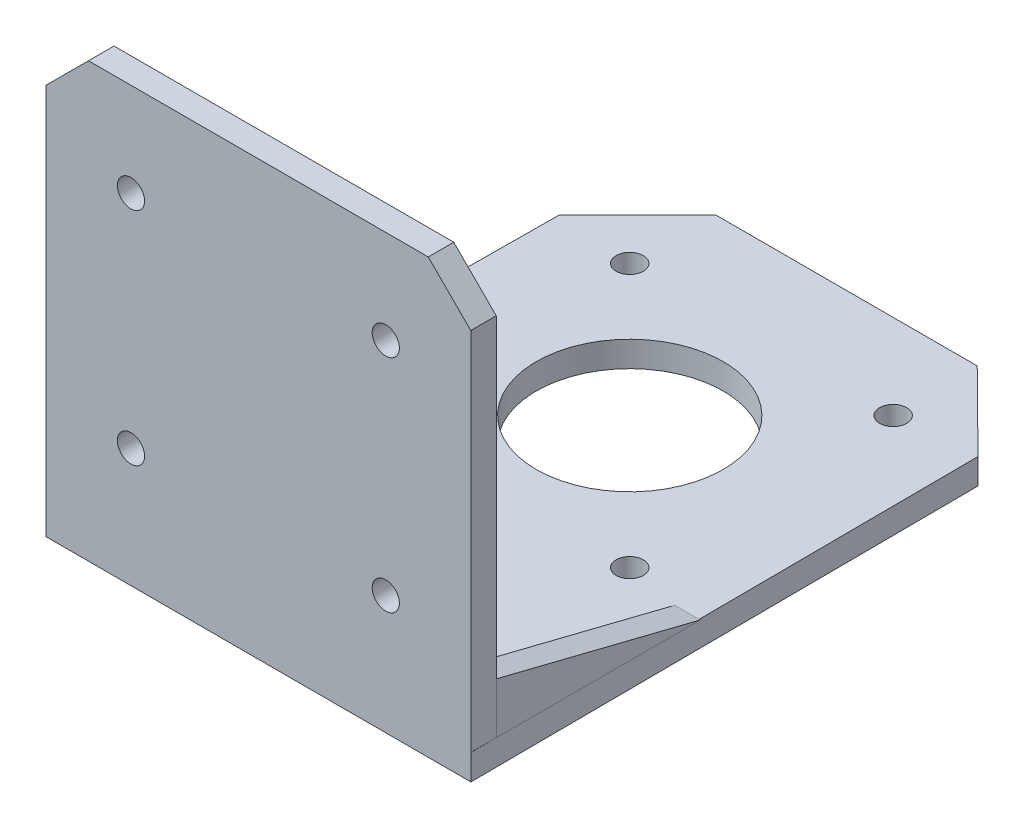
ISO-10303-21;
HEADER;
FILE_DESCRIPTION(('STEP AP214'),'2;1');
FILE_NAME('part.step','',(''),(''),'','','');
FILE_SCHEMA(('AUTOMOTIVE_DESIGN { 1 0 10303 214 1 1 1 1 }'));
ENDSEC;
DATA;
#1=APPLICATION_CONTEXT('core data for automotive mechanical design processes');
#2=APPLICATION_PROTOCOL_DEFINITION('international standard','automotive_design',2000,#1);
#3=PRODUCT_CONTEXT('',#1,'mechanical');
#4=PRODUCT('Part','Part','',(#3));
#5=PRODUCT_RELATED_PRODUCT_CATEGORY('part','',(#4));
#6=PRODUCT_DEFINITION_FORMATION('','',#4);
#7=PRODUCT_DEFINITION_CONTEXT('part definition',#1,'design');
#8=PRODUCT_DEFINITION('design','',#6,#7);
#9=PRODUCT_DEFINITION_SHAPE('','',#8);
#10=(LENGTH_UNIT() NAMED_UNIT(*) SI_UNIT(.MILLI.,.METRE.));
#11=(NAMED_UNIT(*) PLANE_ANGLE_UNIT() SI_UNIT($,.RADIAN.));
#12=(NAMED_UNIT(*) SI_UNIT($,.STERADIAN.) SOLID_ANGLE_UNIT());
#13=UNCERTAINTY_MEASURE_WITH_UNIT(LENGTH_MEASURE(1.E-05),#10,'distance_accuracy_value','');
#14=(GEOMETRIC_REPRESENTATION_CONTEXT(3) GLOBAL_UNCERTAINTY_ASSIGNED_CONTEXT((#13)) GLOBAL_UNIT_ASSIGNED_CONTEXT((#10,
#11,#12)) REPRESENTATION_CONTEXT('',''));
#15=CARTESIAN_POINT('',(0.,0.,0.));
#16=DIRECTION('',(0.,0.,1.));
#17=DIRECTION('',(1.,0.,0.));
#18=AXIS2_PLACEMENT_3D('',#15,#16,#17);
#19=CARTESIAN_POINT('',(-3.29738896012782,9.,61.689517543686));
#20=DIRECTION('',(0.,-0.970142500145332,0.242535625036333));
#21=DIRECTION('',(0.,-0.242535625036333,-0.970142500145332));
#22=AXIS2_PLACEMENT_3D('',#19,#20,#21);
#23=PLANE('',#22);
#24=DIRECTION('',(0.,-0.242535625036333,-0.970142500145332));
#25=VECTOR('',#24,1.);
#26=CARTESIAN_POINT('',(-0.29738896012782,9.,61.689517543686));
#27=LINE('',#26,#25);
#28=CARTESIAN_POINT('',(-0.29738896012782,9.,61.689517543686));
#29=VERTEX_POINT('',#28);
#30=CARTESIAN_POINT('',(-0.29738896012782,3.,37.689517543686));
#31=VERTEX_POINT('',#30);
#32=EDGE_CURVE('E92',#29,#31,#27,.T.);
#33=ORIENTED_EDGE('',*,*,#32,.T.);
#34=DIRECTION('',(1.,0.,0.));
#35=VECTOR('',#34,1.);
#36=CARTESIAN_POINT('',(-3.29738896012782,3.,37.689517543686));
#37=LINE('',#36,#35);
#38=CARTESIAN_POINT('',(-3.29738896012782,3.,37.689517543686));
#39=VERTEX_POINT('',#38);
#40=EDGE_CURVE('E12',#39,#31,#37,.T.);
#41=ORIENTED_EDGE('',*,*,#40,.F.);
#42=DIRECTION('',(0.,-0.242535625036333,-0.970142500145332));
#43=VECTOR('',#42,1.);
#44=CARTESIAN_POINT('',(-3.29738896012782,9.,61.689517543686));
#45=LINE('',#44,#43);
#46=CARTESIAN_POINT('',(-3.29738896012782,9.,61.689517543686));
#47=VERTEX_POINT('',#46);
#48=EDGE_CURVE('E85',#47,#39,#45,.T.);
#49=ORIENTED_EDGE('',*,*,#48,.F.);
#50=DIRECTION('',(1.,0.,0.));
#51=VECTOR('',#50,1.);
#52=CARTESIAN_POINT('',(-3.29738896012782,9.,61.689517543686));
#53=LINE('',#52,#51);
#54=EDGE_CURVE('E93',#47,#29,#53,.T.);
#55=ORIENTED_EDGE('',*,*,#54,.T.);
#56=EDGE_LOOP('',(#33,#41,#49,#55));
#57=FACE_BOUND('',#56,.T.);
#58=ADVANCED_FACE('F45',(#57),#23,.F.);
#59=CARTESIAN_POINT('',(-3.29738896012782,3.,61.689517543686));
#60=DIRECTION('',(0.,1.,0.));
#61=DIRECTION('',(0.,0.,1.));
#62=AXIS2_PLACEMENT_3D('',#59,#60,#61);
#63=PLANE('',#62);
#64=DIRECTION('',(0.,0.,1.));
#65=VECTOR('',#64,1.);
#66=CARTESIAN_POINT('',(-0.29738896012782,3.,61.689517543686));
#67=LINE('',#66,#65);
#68=CARTESIAN_POINT('',(-0.29738896012782,3.,61.689517543686));
#69=VERTEX_POINT('',#68);
#70=EDGE_CURVE('E73',#31,#69,#67,.T.);
#71=ORIENTED_EDGE('',*,*,#70,.T.);
#72=DIRECTION('',(1.,0.,0.));
#73=VECTOR('',#72,1.);
#74=CARTESIAN_POINT('',(-3.29738896012782,3.,61.689517543686));
#75=LINE('',#74,#73);
#76=CARTESIAN_POINT('',(-3.29738896012782,3.,61.689517543686));
#77=VERTEX_POINT('',#76);
#78=EDGE_CURVE('E53',#77,#69,#75,.T.);
#79=ORIENTED_EDGE('',*,*,#78,.F.);
#80=DIRECTION('',(0.,0.,1.));
#81=VECTOR('',#80,1.);
#82=CARTESIAN_POINT('',(-3.29738896012782,3.,61.689517543686));
#83=LINE('',#82,#81);
#84=EDGE_CURVE('E81',#39,#77,#83,.T.);
#85=ORIENTED_EDGE('',*,*,#84,.F.);
#86=ORIENTED_EDGE('',*,*,#40,.T.);
#87=EDGE_LOOP('',(#71,#79,#85,#86));
#88=FACE_BOUND('',#87,.T.);
#89=ADVANCED_FACE('F82',(#88),#63,.F.);
#90=CARTESIAN_POINT('',(-3.29738896012782,3.,61.689517543686));
#91=DIRECTION('',(0.,0.,-1.));
#92=DIRECTION('',(-1.,0.,0.));
#93=AXIS2_PLACEMENT_3D('',#90,#91,#92);
#94=PLANE('',#93);
#95=DIRECTION('',(0.,1.,0.));
#96=VECTOR('',#95,1.);
#97=CARTESIAN_POINT('',(-0.29738896012782,3.,61.689517543686));
#98=LINE('',#97,#96);
#99=EDGE_CURVE('E78',#69,#29,#98,.T.);
#100=ORIENTED_EDGE('',*,*,#99,.T.);
#101=ORIENTED_EDGE('',*,*,#54,.F.);
#102=DIRECTION('',(0.,1.,0.));
#103=VECTOR('',#102,1.);
#104=CARTESIAN_POINT('',(-3.29738896012782,3.,61.689517543686));
#105=LINE('',#104,#103);
#106=EDGE_CURVE('E61',#77,#47,#105,.T.);
#107=ORIENTED_EDGE('',*,*,#106,.F.);
#108=ORIENTED_EDGE('',*,*,#78,.T.);
#109=EDGE_LOOP('',(#100,#101,#107,#108));
#110=FACE_BOUND('',#109,.T.);
#111=ADVANCED_FACE('F100',(#110),#94,.F.);
#112=CARTESIAN_POINT('',(-3.29738896012782,0.,0.));
#113=DIRECTION('',(1.,0.,0.));
#114=DIRECTION('',(0.,0.,-1.));
#115=AXIS2_PLACEMENT_3D('',#112,#113,#114);
#116=PLANE('',#115);
#117=ORIENTED_EDGE('',*,*,#48,.T.);
#118=ORIENTED_EDGE('',*,*,#84,.T.);
#119=ORIENTED_EDGE('',*,*,#106,.T.);
#120=EDGE_LOOP('',(#117,#118,#119));
#121=FACE_BOUND('',#120,.T.);
#122=ADVANCED_FACE('F88',(#121),#116,.F.);
#123=CARTESIAN_POINT('',(-0.29738896012782,0.,0.));
#124=DIRECTION('',(1.,0.,0.));
#125=DIRECTION('',(0.,0.,-1.));
#126=AXIS2_PLACEMENT_3D('',#123,#124,#125);
#127=PLANE('',#126);
#128=ORIENTED_EDGE('',*,*,#32,.F.);
#129=ORIENTED_EDGE('',*,*,#99,.F.);
#130=ORIENTED_EDGE('',*,*,#70,.F.);
#131=EDGE_LOOP('',(#128,#129,#130));
#132=FACE_BOUND('',#131,.T.);
#133=ADVANCED_FACE('F101',(#132),#127,.T.);
#134=CLOSED_SHELL('',(#58,#89,#111,#122,#133));
#135=MANIFOLD_SOLID_BREP('B2',#134);
#136=CARTESIAN_POINT('',(-47.2602013690457,3.,37.689517543686));
#137=DIRECTION('',(0.,-0.970142500145332,0.242535625036333));
#138=DIRECTION('',(0.,-0.242535625036333,-0.970142500145332));
#139=AXIS2_PLACEMENT_3D('',#136,#137,#138);
#140=PLANE('',#139);
#141=DIRECTION('',(0.,0.242535625036333,0.970142500145332));
#142=VECTOR('',#141,1.);
#143=CARTESIAN_POINT('',(-50.2602013690457,3.,37.689517543686));
#144=LINE('',#143,#142);
#145=CARTESIAN_POINT('',(-50.2602013690457,3.,37.689517543686));
#146=VERTEX_POINT('',#145);
#147=CARTESIAN_POINT('',(-50.2602013690457,9.,61.689517543686));
#148=VERTEX_POINT('',#147);
#149=EDGE_CURVE('E199',#146,#148,#144,.T.);
#150=ORIENTED_EDGE('',*,*,#149,.T.);
#151=DIRECTION('',(-1.,0.,0.));
#152=VECTOR('',#151,1.);
#153=CARTESIAN_POINT('',(-47.2602013690457,9.,61.689517543686));
#154=LINE('',#153,#152);
#155=CARTESIAN_POINT('',(-47.2602013690457,9.,61.689517543686));
#156=VERTEX_POINT('',#155);
#157=EDGE_CURVE('E43',#156,#148,#154,.T.);
#158=ORIENTED_EDGE('',*,*,#157,.F.);
#159=DIRECTION('',(0.,0.242535625036333,0.970142500145332));
#160=VECTOR('',#159,1.);
#161=CARTESIAN_POINT('',(-47.2602013690457,3.,37.689517543686));
#162=LINE('',#161,#160);
#163=CARTESIAN_POINT('',(-47.2602013690457,3.,37.689517543686));
#164=VERTEX_POINT('',#163);
#165=EDGE_CURVE('E192',#164,#156,#162,.T.);
#166=ORIENTED_EDGE('',*,*,#165,.F.);
#167=DIRECTION('',(-1.,0.,0.));
#168=VECTOR('',#167,1.);
#169=CARTESIAN_POINT('',(-47.2602013690457,3.,37.689517543686));
#170=LINE('',#169,#168);
#171=EDGE_CURVE('E200',#164,#146,#170,.T.);
#172=ORIENTED_EDGE('',*,*,#171,.T.);
#173=EDGE_LOOP('',(#150,#158,#166,#172));
#174=FACE_BOUND('',#173,.T.);
#175=ADVANCED_FACE('F152',(#174),#140,.F.);
#176=CARTESIAN_POINT('',(-47.2602013690457,3.,61.689517543686));
#177=DIRECTION('',(0.,0.,-1.));
#178=DIRECTION('',(-1.,0.,0.));
#179=AXIS2_PLACEMENT_3D('',#176,#177,#178);
#180=PLANE('',#179);
#181=DIRECTION('',(0.,-1.,0.));
#182=VECTOR('',#181,1.);
#183=CARTESIAN_POINT('',(-50.2602013690457,3.,61.689517543686));
#184=LINE('',#183,#182);
#185=CARTESIAN_POINT('',(-50.2602013690457,3.,61.689517543686));
#186=VERTEX_POINT('',#185);
#187=EDGE_CURVE('E180',#148,#186,#184,.T.);
#188=ORIENTED_EDGE('',*,*,#187,.T.);
#189=DIRECTION('',(-1.,0.,0.));
#190=VECTOR('',#189,1.);
#191=CARTESIAN_POINT('',(-47.2602013690457,3.,61.689517543686));
#192=LINE('',#191,#190);
#193=CARTESIAN_POINT('',(-47.2602013690457,3.,61.689517543686));
#194=VERTEX_POINT('',#193);
#195=EDGE_CURVE('E160',#194,#186,#192,.T.);
#196=ORIENTED_EDGE('',*,*,#195,.F.);
#197=DIRECTION('',(0.,-1.,0.));
#198=VECTOR('',#197,1.);
#199=CARTESIAN_POINT('',(-47.2602013690457,3.,61.689517543686));
#200=LINE('',#199,#198);
#201=EDGE_CURVE('E188',#156,#194,#200,.T.);
#202=ORIENTED_EDGE('',*,*,#201,.F.);
#203=ORIENTED_EDGE('',*,*,#157,.T.);
#204=EDGE_LOOP('',(#188,#196,#202,#203));
#205=FACE_BOUND('',#204,.T.);
#206=ADVANCED_FACE('F189',(#205),#180,.F.);
#207=CARTESIAN_POINT('',(-47.2602013690457,3.,61.689517543686));
#208=DIRECTION('',(0.,1.,0.));
#209=DIRECTION('',(0.,0.,1.));
#210=AXIS2_PLACEMENT_3D('',#207,#208,#209);
#211=PLANE('',#210);
#212=DIRECTION('',(0.,0.,-1.));
#213=VECTOR('',#212,1.);
#214=CARTESIAN_POINT('',(-50.2602013690457,3.,61.689517543686));
#215=LINE('',#214,#213);
#216=EDGE_CURVE('E185',#186,#146,#215,.T.);
#217=ORIENTED_EDGE('',*,*,#216,.T.);
#218=ORIENTED_EDGE('',*,*,#171,.F.);
#219=DIRECTION('',(0.,0.,-1.));
#220=VECTOR('',#219,1.);
#221=CARTESIAN_POINT('',(-47.2602013690457,3.,61.689517543686));
#222=LINE('',#221,#220);
#223=EDGE_CURVE('E168',#194,#164,#222,.T.);
#224=ORIENTED_EDGE('',*,*,#223,.F.);
#225=ORIENTED_EDGE('',*,*,#195,.T.);
#226=EDGE_LOOP('',(#217,#218,#224,#225));
#227=FACE_BOUND('',#226,.T.);
#228=ADVANCED_FACE('F207',(#227),#211,.F.);
#229=CARTESIAN_POINT('',(-47.2602013690457,0.,0.));
#230=DIRECTION('',(-1.,0.,0.));
#231=DIRECTION('',(0.,0.,1.));
#232=AXIS2_PLACEMENT_3D('',#229,#230,#231);
#233=PLANE('',#232);
#234=ORIENTED_EDGE('',*,*,#165,.T.);
#235=ORIENTED_EDGE('',*,*,#201,.T.);
#236=ORIENTED_EDGE('',*,*,#223,.T.);
#237=EDGE_LOOP('',(#234,#235,#236));
#238=FACE_BOUND('',#237,.T.);
#239=ADVANCED_FACE('F195',(#238),#233,.F.);
#240=CARTESIAN_POINT('',(-50.2602013690457,0.,0.));
#241=DIRECTION('',(-1.,0.,0.));
#242=DIRECTION('',(0.,0.,1.));
#243=AXIS2_PLACEMENT_3D('',#240,#241,#242);
#244=PLANE('',#243);
#245=ORIENTED_EDGE('',*,*,#149,.F.);
#246=ORIENTED_EDGE('',*,*,#216,.F.);
#247=ORIENTED_EDGE('',*,*,#187,.F.);
#248=EDGE_LOOP('',(#245,#246,#247));
#249=FACE_BOUND('',#248,.T.);
#250=ADVANCED_FACE('F208',(#249),#244,.T.);
#251=CLOSED_SHELL('',(#175,#206,#228,#239,#250));
#252=MANIFOLD_SOLID_BREP('B6',#251);
#253=CARTESIAN_POINT('',(0.,3.,0.));
#254=DIRECTION('',(0.,-1.,0.));
#255=DIRECTION('',(0.,0.,-1.));
#256=AXIS2_PLACEMENT_3D('',#253,#254,#255);
#257=PLANE('',#256);
#258=CARTESIAN_POINT('',(-9.78107085389719,3.,36.5));
#259=DIRECTION('',(0.,1.,0.));
#260=DIRECTION('',(0.,0.,1.));
#261=AXIS2_PLACEMENT_3D('',#258,#259,#260);
#262=CIRCLE('',#261,1.6);
#263=CARTESIAN_POINT('',(-9.78107085389719,3.,38.1));
#264=VERTEX_POINT('',#263);
#265=EDGE_CURVE('E370',#264,#264,#262,.T.);
#266=ORIENTED_EDGE('',*,*,#265,.F.);
#267=EDGE_LOOP('',(#266));
#268=FACE_BOUND('',#267,.T.);
#269=CARTESIAN_POINT('',(-40.7810708538972,3.,36.5));
#270=DIRECTION('',(0.,1.,0.));
#271=DIRECTION('',(0.,0.,1.));
#272=AXIS2_PLACEMENT_3D('',#269,#270,#271);
#273=CIRCLE('',#272,1.6);
#274=CARTESIAN_POINT('',(-40.7810708538972,3.,38.1));
#275=VERTEX_POINT('',#274);
#276=EDGE_CURVE('E376',#275,#275,#273,.T.);
#277=ORIENTED_EDGE('',*,*,#276,.F.);
#278=EDGE_LOOP('',(#277));
#279=FACE_BOUND('',#278,.T.);
#280=CARTESIAN_POINT('',(-9.7810708538972,3.,5.5));
#281=DIRECTION('',(0.,1.,0.));
#282=DIRECTION('',(0.,0.,1.));
#283=AXIS2_PLACEMENT_3D('',#280,#281,#282);
#284=CIRCLE('',#283,1.6);
#285=CARTESIAN_POINT('',(-9.7810708538972,3.,7.1));
#286=VERTEX_POINT('',#285);
#287=EDGE_CURVE('E382',#286,#286,#284,.T.);
#288=ORIENTED_EDGE('',*,*,#287,.F.);
#289=EDGE_LOOP('',(#288));
#290=FACE_BOUND('',#289,.T.);
#291=CARTESIAN_POINT('',(-40.7810708538972,3.,5.50000000000001));
#292=DIRECTION('',(0.,1.,0.));
#293=DIRECTION('',(0.,0.,1.));
#294=AXIS2_PLACEMENT_3D('',#291,#292,#293);
#295=CIRCLE('',#294,1.6);
#296=CARTESIAN_POINT('',(-40.7810708538972,3.,7.1));
#297=VERTEX_POINT('',#296);
#298=EDGE_CURVE('E388',#297,#297,#295,.T.);
#299=ORIENTED_EDGE('',*,*,#298,.F.);
#300=EDGE_LOOP('',(#299));
#301=FACE_BOUND('',#300,.T.);
#302=CARTESIAN_POINT('',(-25.2810708538972,3.,21.));
#303=DIRECTION('',(0.,1.,0.));
#304=DIRECTION('',(0.,0.,1.));
#305=AXIS2_PLACEMENT_3D('',#302,#303,#304);
#306=CIRCLE('',#305,11.);
#307=CARTESIAN_POINT('',(-25.2810708538972,3.,32.));
#308=VERTEX_POINT('',#307);
#309=EDGE_CURVE('E394',#308,#308,#306,.T.);
#310=ORIENTED_EDGE('',*,*,#309,.F.);
#311=EDGE_LOOP('',(#310));
#312=FACE_BOUND('',#311,.T.);
#313=DIRECTION('',(-1.,0.,0.));
#314=VECTOR('',#313,1.);
#315=CARTESIAN_POINT('',(-50.2810708538972,3.,61.689517543686));
#316=LINE('',#315,#314);
#317=CARTESIAN_POINT('',(-0.29738896012782,3.,61.689517543686));
#318=VERTEX_POINT('',#317);
#319=CARTESIAN_POINT('',(-50.2602013690457,3.,61.689517543686));
#320=VERTEX_POINT('',#319);
#321=EDGE_CURVE('E452',#318,#320,#316,.T.);
#322=ORIENTED_EDGE('',*,*,#321,.F.);
#323=DIRECTION('',(-0.00543928827875593,0.,-0.999985206962093));
#324=VECTOR('',#323,1.);
#325=CARTESIAN_POINT('',(-0.607432978509827,3.,4.68951754368604));
#326=LINE('',#325,#324);
#327=CARTESIAN_POINT('',(-0.607432978509827,3.,4.68951754368604));
#328=VERTEX_POINT('',#327);
#329=EDGE_CURVE('E406',#318,#328,#326,.T.);
#330=ORIENTED_EDGE('',*,*,#329,.T.);
#331=DIRECTION('',(-0.710603955969132,0.,-0.703592224062362));
#332=VECTOR('',#331,1.);
#333=CARTESIAN_POINT('',(-9.88939898248613,3.,-4.50086065439509));
#334=LINE('',#333,#332);
#335=CARTESIAN_POINT('',(-9.88939898248613,3.,-4.50086065439509));
#336=VERTEX_POINT('',#335);
#337=EDGE_CURVE('E409',#328,#336,#334,.T.);
#338=ORIENTED_EDGE('',*,*,#337,.T.);
#339=DIRECTION('',(-1.,0.,0.));
#340=VECTOR('',#339,1.);
#341=CARTESIAN_POINT('',(-9.88939898248613,3.,-4.50086065439509));
#342=LINE('',#341,#340);
#343=CARTESIAN_POINT('',(-40.6727427253083,3.,-4.50086065439509));
#344=VERTEX_POINT('',#343);
#345=EDGE_CURVE('E411',#336,#344,#342,.T.);
#346=ORIENTED_EDGE('',*,*,#345,.T.);
#347=DIRECTION('',(-0.707106781186547,0.,0.707106781186548));
#348=VECTOR('',#347,1.);
#349=CARTESIAN_POINT('',(-49.8636850814306,3.,4.69008170172729));
#350=LINE('',#349,#348);
#351=CARTESIAN_POINT('',(-49.8636850814306,3.,4.69008170172729));
#352=VERTEX_POINT('',#351);
#353=EDGE_CURVE('E413',#344,#352,#350,.T.);
#354=ORIENTED_EDGE('',*,*,#353,.T.);
#355=DIRECTION('',(-0.00695632663438336,0.,0.999975804467166));
#356=VECTOR('',#355,1.);
#357=CARTESIAN_POINT('',(-49.8636850814306,3.,4.69008170172729));
#358=LINE('',#357,#356);
#359=EDGE_CURVE('E400',#352,#320,#358,.T.);
#360=ORIENTED_EDGE('',*,*,#359,.T.);
#361=EDGE_LOOP('',(#322,#330,#338,#346,#354,#360));
#362=FACE_BOUND('',#361,.T.);
#363=ADVANCED_FACE('F251',(#268,#279,#290,#301,#312,#362),#257,.F.);
#364=DIRECTION('',(0.,0.,-1.));
#365=VECTOR('',#364,1.);
#366=CARTESIAN_POINT('',(-0.29738896012782,3.,64.689517543686));
#367=LINE('',#366,#365);
#368=CARTESIAN_POINT('',(-0.29738896012782,3.,64.689517543686));
#369=VERTEX_POINT('',#368);
#370=EDGE_CURVE('E359',#369,#318,#367,.T.);
#371=ORIENTED_EDGE('',*,*,#370,.F.);
#372=DIRECTION('',(1.,0.,0.));
#373=VECTOR('',#372,1.);
#374=CARTESIAN_POINT('',(-0.28107085389719,3.,64.689517543686));
#375=LINE('',#374,#373);
#376=CARTESIAN_POINT('',(-0.28107085389719,3.,64.689517543686));
#377=VERTEX_POINT('',#376);
#378=EDGE_CURVE('E403',#369,#377,#375,.T.);
#379=ORIENTED_EDGE('',*,*,#378,.T.);
#380=EDGE_CURVE('E407',#377,#318,#326,.T.);
#381=ORIENTED_EDGE('',*,*,#380,.T.);
#382=EDGE_LOOP('',(#371,#379,#381));
#383=FACE_BOUND('',#382,.T.);
#384=ADVANCED_FACE('F535',(#383),#257,.F.);
#385=CARTESIAN_POINT('',(0.,0.,0.));
#386=DIRECTION('',(0.,-1.,0.));
#387=DIRECTION('',(0.,0.,-1.));
#388=AXIS2_PLACEMENT_3D('',#385,#386,#387);
#389=PLANE('',#388);
#390=CARTESIAN_POINT('',(-40.7810708538972,0.,36.5));
#391=DIRECTION('',(0.,1.,0.));
#392=DIRECTION('',(0.,0.,1.));
#393=AXIS2_PLACEMENT_3D('',#390,#391,#392);
#394=CIRCLE('',#393,1.6);
#395=CARTESIAN_POINT('',(-40.7810708538972,0.,38.1));
#396=VERTEX_POINT('',#395);
#397=EDGE_CURVE('E373',#396,#396,#394,.T.);
#398=ORIENTED_EDGE('',*,*,#397,.T.);
#399=EDGE_LOOP('',(#398));
#400=FACE_BOUND('',#399,.T.);
#401=CARTESIAN_POINT('',(-40.7810708538972,0.,5.50000000000001));
#402=DIRECTION('',(0.,1.,0.));
#403=DIRECTION('',(0.,0.,1.));
#404=AXIS2_PLACEMENT_3D('',#401,#402,#403);
#405=CIRCLE('',#404,1.6);
#406=CARTESIAN_POINT('',(-40.7810708538972,0.,7.1));
#407=VERTEX_POINT('',#406);
#408=EDGE_CURVE('E385',#407,#407,#405,.T.);
#409=ORIENTED_EDGE('',*,*,#408,.T.);
#410=EDGE_LOOP('',(#409));
#411=FACE_BOUND('',#410,.T.);
#412=DIRECTION('',(-0.00695632663438336,0.,0.999975804467166));
#413=VECTOR('',#412,1.);
#414=CARTESIAN_POINT('',(-49.8636850814306,0.,4.69008170172729));
#415=LINE('',#414,#413);
#416=CARTESIAN_POINT('',(-49.8636850814306,0.,4.69008170172729));
#417=VERTEX_POINT('',#416);
#418=CARTESIAN_POINT('',(-50.2810708538972,0.,64.689517543686));
#419=VERTEX_POINT('',#418);
#420=EDGE_CURVE('E397',#417,#419,#415,.T.);
#421=ORIENTED_EDGE('',*,*,#420,.F.);
#422=DIRECTION('',(-0.707106781186547,0.,0.707106781186548));
#423=VECTOR('',#422,1.);
#424=CARTESIAN_POINT('',(-49.8636850814306,0.,4.69008170172729));
#425=LINE('',#424,#423);
#426=CARTESIAN_POINT('',(-40.6727427253083,0.,-4.50086065439509));
#427=VERTEX_POINT('',#426);
#428=EDGE_CURVE('E426',#427,#417,#425,.T.);
#429=ORIENTED_EDGE('',*,*,#428,.F.);
#430=DIRECTION('',(-1.,0.,0.));
#431=VECTOR('',#430,1.);
#432=CARTESIAN_POINT('',(-9.88939898248613,0.,-4.50086065439509));
#433=LINE('',#432,#431);
#434=CARTESIAN_POINT('',(-9.88939898248613,0.,-4.50086065439509));
#435=VERTEX_POINT('',#434);
#436=EDGE_CURVE('E424',#435,#427,#433,.T.);
#437=ORIENTED_EDGE('',*,*,#436,.F.);
#438=DIRECTION('',(-0.710603955969132,0.,-0.703592224062362));
#439=VECTOR('',#438,1.);
#440=CARTESIAN_POINT('',(-9.88939898248613,0.,-4.50086065439509));
#441=LINE('',#440,#439);
#442=CARTESIAN_POINT('',(-0.607432978509827,0.,4.68951754368604));
#443=VERTEX_POINT('',#442);
#444=EDGE_CURVE('E422',#443,#435,#441,.T.);
#445=ORIENTED_EDGE('',*,*,#444,.F.);
#446=DIRECTION('',(-0.00543928827875593,0.,-0.999985206962093));
#447=VECTOR('',#446,1.);
#448=CARTESIAN_POINT('',(-0.607432978509827,0.,4.68951754368604));
#449=LINE('',#448,#447);
#450=CARTESIAN_POINT('',(-0.28107085389719,0.,64.689517543686));
#451=VERTEX_POINT('',#450);
#452=EDGE_CURVE('E420',#451,#443,#449,.T.);
#453=ORIENTED_EDGE('',*,*,#452,.F.);
#454=DIRECTION('',(1.,0.,0.));
#455=VECTOR('',#454,1.);
#456=CARTESIAN_POINT('',(-0.28107085389719,0.,64.689517543686));
#457=LINE('',#456,#455);
#458=EDGE_CURVE('E418',#419,#451,#457,.T.);
#459=ORIENTED_EDGE('',*,*,#458,.F.);
#460=EDGE_LOOP('',(#421,#429,#437,#445,#453,#459));
#461=FACE_BOUND('',#460,.T.);
#462=CARTESIAN_POINT('',(-25.2810708538972,0.,21.));
#463=DIRECTION('',(0.,1.,0.));
#464=DIRECTION('',(0.,0.,1.));
#465=AXIS2_PLACEMENT_3D('',#462,#463,#464);
#466=CIRCLE('',#465,11.);
#467=CARTESIAN_POINT('',(-25.2810708538972,0.,32.));
#468=VERTEX_POINT('',#467);
#469=EDGE_CURVE('E391',#468,#468,#466,.T.);
#470=ORIENTED_EDGE('',*,*,#469,.T.);
#471=EDGE_LOOP('',(#470));
#472=FACE_BOUND('',#471,.T.);
#473=CARTESIAN_POINT('',(-9.7810708538972,0.,5.5));
#474=DIRECTION('',(0.,1.,0.));
#475=DIRECTION('',(0.,0.,1.));
#476=AXIS2_PLACEMENT_3D('',#473,#474,#475);
#477=CIRCLE('',#476,1.6);
#478=CARTESIAN_POINT('',(-9.7810708538972,0.,7.1));
#479=VERTEX_POINT('',#478);
#480=EDGE_CURVE('E379',#479,#479,#477,.T.);
#481=ORIENTED_EDGE('',*,*,#480,.T.);
#482=EDGE_LOOP('',(#481));
#483=FACE_BOUND('',#482,.T.);
#484=CARTESIAN_POINT('',(-9.78107085389719,0.,36.5));
#485=DIRECTION('',(0.,1.,0.));
#486=DIRECTION('',(0.,0.,1.));
#487=AXIS2_PLACEMENT_3D('',#484,#485,#486);
#488=CIRCLE('',#487,1.6);
#489=CARTESIAN_POINT('',(-9.78107085389719,0.,38.1));
#490=VERTEX_POINT('',#489);
#491=EDGE_CURVE('E369',#490,#490,#488,.T.);
#492=ORIENTED_EDGE('',*,*,#491,.T.);
#493=EDGE_LOOP('',(#492));
#494=FACE_BOUND('',#493,.T.);
#495=ADVANCED_FACE('F531',(#400,#411,#461,#472,#483,#494),#389,.T.);
#496=CARTESIAN_POINT('',(-49.8636850814306,3.,4.69008170172729));
#497=DIRECTION('',(0.999975804467166,0.,0.00695632663438336));
#498=DIRECTION('',(0.00695632663438336,0.,-0.999975804467166));
#499=AXIS2_PLACEMENT_3D('',#496,#497,#498);
#500=PLANE('',#499);
#501=ORIENTED_EDGE('',*,*,#420,.T.);
#502=DIRECTION('',(0.,-1.,0.));
#503=VECTOR('',#502,1.);
#504=CARTESIAN_POINT('',(-50.2810708538972,3.,64.689517543686));
#505=LINE('',#504,#503);
#506=CARTESIAN_POINT('',(-50.2810708538972,3.,64.689517543686));
#507=VERTEX_POINT('',#506);
#508=EDGE_CURVE('E442',#507,#419,#505,.T.);
#509=ORIENTED_EDGE('',*,*,#508,.F.);
#510=EDGE_CURVE('E404',#320,#507,#358,.T.);
#511=ORIENTED_EDGE('',*,*,#510,.F.);
#512=ORIENTED_EDGE('',*,*,#359,.F.);
#513=DIRECTION('',(0.,-1.,0.));
#514=VECTOR('',#513,1.);
#515=CARTESIAN_POINT('',(-49.8636850814306,3.,4.69008170172729));
#516=LINE('',#515,#514);
#517=EDGE_CURVE('E415',#352,#417,#516,.T.);
#518=ORIENTED_EDGE('',*,*,#517,.T.);
#519=EDGE_LOOP('',(#501,#509,#511,#512,#518));
#520=FACE_BOUND('',#519,.T.);
#521=ADVANCED_FACE('F253',(#520),#500,.F.);
#522=CARTESIAN_POINT('',(-0.28107085389719,3.,64.689517543686));
#523=DIRECTION('',(0.,0.,-1.));
#524=DIRECTION('',(-1.,0.,0.));
#525=AXIS2_PLACEMENT_3D('',#522,#523,#524);
#526=PLANE('',#525);
#527=CARTESIAN_POINT('',(-10.2973889601278,40.,64.689517543686));
#528=DIRECTION('',(0.,0.,-1.));
#529=DIRECTION('',(-1.,0.,0.));
#530=AXIS2_PLACEMENT_3D('',#527,#528,#529);
#531=CIRCLE('',#530,1.6);
#532=CARTESIAN_POINT('',(-11.8973889601278,40.,64.689517543686));
#533=VERTEX_POINT('',#532);
#534=EDGE_CURVE('E495',#533,#533,#531,.T.);
#535=ORIENTED_EDGE('',*,*,#534,.T.);
#536=EDGE_LOOP('',(#535));
#537=FACE_BOUND('',#536,.T.);
#538=CARTESIAN_POINT('',(-40.2810708538972,40.,64.689517543686));
#539=DIRECTION('',(0.,0.,-1.));
#540=DIRECTION('',(-1.,0.,0.));
#541=AXIS2_PLACEMENT_3D('',#538,#539,#540);
#542=CIRCLE('',#541,1.6);
#543=CARTESIAN_POINT('',(-41.8810708538972,40.,64.689517543686));
#544=VERTEX_POINT('',#543);
#545=EDGE_CURVE('E489',#544,#544,#542,.T.);
#546=ORIENTED_EDGE('',*,*,#545,.T.);
#547=EDGE_LOOP('',(#546));
#548=FACE_BOUND('',#547,.T.);
#549=CARTESIAN_POINT('',(-40.2810708538972,14.,64.689517543686));
#550=DIRECTION('',(0.,0.,-1.));
#551=DIRECTION('',(-1.,0.,0.));
#552=AXIS2_PLACEMENT_3D('',#549,#550,#551);
#553=CIRCLE('',#552,1.6);
#554=CARTESIAN_POINT('',(-41.8810708538972,14.,64.689517543686));
#555=VERTEX_POINT('',#554);
#556=EDGE_CURVE('E483',#555,#555,#553,.T.);
#557=ORIENTED_EDGE('',*,*,#556,.T.);
#558=EDGE_LOOP('',(#557));
#559=FACE_BOUND('',#558,.T.);
#560=CARTESIAN_POINT('',(-10.2973889601278,14.,64.689517543686));
#561=DIRECTION('',(0.,0.,-1.));
#562=DIRECTION('',(-1.,0.,0.));
#563=AXIS2_PLACEMENT_3D('',#560,#561,#562);
#564=CIRCLE('',#563,1.6);
#565=CARTESIAN_POINT('',(-11.8973889601278,14.,64.689517543686));
#566=VERTEX_POINT('',#565);
#567=EDGE_CURVE('E475',#566,#566,#564,.T.);
#568=ORIENTED_EDGE('',*,*,#567,.T.);
#569=EDGE_LOOP('',(#568));
#570=FACE_BOUND('',#569,.T.);
#571=DIRECTION('',(0.,-1.,0.));
#572=VECTOR('',#571,1.);
#573=CARTESIAN_POINT('',(-0.29738896012782,51.,64.689517543686));
#574=LINE('',#573,#572);
#575=CARTESIAN_POINT('',(-0.29738896012782,46.,64.689517543686));
#576=VERTEX_POINT('',#575);
#577=EDGE_CURVE('E360',#576,#369,#574,.T.);
#578=ORIENTED_EDGE('',*,*,#577,.F.);
#579=DIRECTION('',(-0.707106781186548,0.707106781186547,0.));
#580=VECTOR('',#579,1.);
#581=CARTESIAN_POINT('',(21.2107700929875,24.4918409468847,64.689517543686));
#582=LINE('',#581,#580);
#583=CARTESIAN_POINT('',(-5.29738896012782,51.,64.689517543686));
#584=VERTEX_POINT('',#583);
#585=EDGE_CURVE('E340',#576,#584,#582,.T.);
#586=ORIENTED_EDGE('',*,*,#585,.T.);
#587=DIRECTION('',(1.,0.,0.));
#588=VECTOR('',#587,1.);
#589=CARTESIAN_POINT('',(-50.2810708538972,51.,64.689517543686));
#590=LINE('',#589,#588);
#591=CARTESIAN_POINT('',(-45.2810708538972,51.,64.689517543686));
#592=VERTEX_POINT('',#591);
#593=EDGE_CURVE('E448',#592,#584,#590,.T.);
#594=ORIENTED_EDGE('',*,*,#593,.F.);
#595=DIRECTION('',(-0.707106781186548,-0.707106781186548,0.));
#596=VECTOR('',#595,1.);
#597=CARTESIAN_POINT('',(-46.7810708538972,49.5,64.689517543686));
#598=LINE('',#597,#596);
#599=CARTESIAN_POINT('',(-50.2810708538972,46.,64.689517543686));
#600=VERTEX_POINT('',#599);
#601=EDGE_CURVE('E273',#592,#600,#598,.T.);
#602=ORIENTED_EDGE('',*,*,#601,.T.);
#603=DIRECTION('',(0.,-1.,0.));
#604=VECTOR('',#603,1.);
#605=CARTESIAN_POINT('',(-50.2810708538972,51.,64.689517543686));
#606=LINE('',#605,#604);
#607=EDGE_CURVE('E363',#600,#507,#606,.T.);
#608=ORIENTED_EDGE('',*,*,#607,.T.);
#609=ORIENTED_EDGE('',*,*,#508,.T.);
#610=ORIENTED_EDGE('',*,*,#458,.T.);
#611=DIRECTION('',(0.,-1.,0.));
#612=VECTOR('',#611,1.);
#613=CARTESIAN_POINT('',(-0.28107085389719,3.,64.689517543686));
#614=LINE('',#613,#612);
#615=EDGE_CURVE('E439',#377,#451,#614,.T.);
#616=ORIENTED_EDGE('',*,*,#615,.F.);
#617=ORIENTED_EDGE('',*,*,#378,.F.);
#618=EDGE_LOOP('',(#578,#586,#594,#602,#608,#609,#610,#616,#617));
#619=FACE_BOUND('',#618,.T.);
#620=ADVANCED_FACE('F450',(#537,#548,#559,#570,#619),#526,.F.);
#621=CARTESIAN_POINT('',(-0.607432978509827,3.,4.68951754368604));
#622=DIRECTION('',(-0.999985206962093,0.,0.00543928827875593));
#623=DIRECTION('',(0.00543928827875593,0.,0.999985206962093));
#624=AXIS2_PLACEMENT_3D('',#621,#622,#623);
#625=PLANE('',#624);
#626=ORIENTED_EDGE('',*,*,#452,.T.);
#627=DIRECTION('',(0.,-1.,0.));
#628=VECTOR('',#627,1.);
#629=CARTESIAN_POINT('',(-0.607432978509827,3.,4.68951754368604));
#630=LINE('',#629,#628);
#631=EDGE_CURVE('E436',#328,#443,#630,.T.);
#632=ORIENTED_EDGE('',*,*,#631,.F.);
#633=ORIENTED_EDGE('',*,*,#329,.F.);
#634=ORIENTED_EDGE('',*,*,#380,.F.);
#635=ORIENTED_EDGE('',*,*,#615,.T.);
#636=EDGE_LOOP('',(#626,#632,#633,#634,#635));
#637=FACE_BOUND('',#636,.T.);
#638=ADVANCED_FACE('F522',(#637),#625,.F.);
#639=CARTESIAN_POINT('',(-9.88939898248613,3.,-4.50086065439509));
#640=DIRECTION('',(-0.703592224062362,0.,0.710603955969132));
#641=DIRECTION('',(0.710603955969132,0.,0.703592224062362));
#642=AXIS2_PLACEMENT_3D('',#639,#640,#641);
#643=PLANE('',#642);
#644=ORIENTED_EDGE('',*,*,#444,.T.);
#645=DIRECTION('',(0.,-1.,0.));
#646=VECTOR('',#645,1.);
#647=CARTESIAN_POINT('',(-9.88939898248613,3.,-4.50086065439509));
#648=LINE('',#647,#646);
#649=EDGE_CURVE('E433',#336,#435,#648,.T.);
#650=ORIENTED_EDGE('',*,*,#649,.F.);
#651=ORIENTED_EDGE('',*,*,#337,.F.);
#652=ORIENTED_EDGE('',*,*,#631,.T.);
#653=EDGE_LOOP('',(#644,#650,#651,#652));
#654=FACE_BOUND('',#653,.T.);
#655=ADVANCED_FACE('F528',(#654),#643,.F.);
#656=CARTESIAN_POINT('',(-9.88939898248613,3.,-4.50086065439509));
#657=DIRECTION('',(0.,0.,1.));
#658=DIRECTION('',(1.,0.,0.));
#659=AXIS2_PLACEMENT_3D('',#656,#657,#658);
#660=PLANE('',#659);
#661=ORIENTED_EDGE('',*,*,#436,.T.);
#662=DIRECTION('',(0.,-1.,0.));
#663=VECTOR('',#662,1.);
#664=CARTESIAN_POINT('',(-40.6727427253083,3.,-4.50086065439509));
#665=LINE('',#664,#663);
#666=EDGE_CURVE('E430',#344,#427,#665,.T.);
#667=ORIENTED_EDGE('',*,*,#666,.F.);
#668=ORIENTED_EDGE('',*,*,#345,.F.);
#669=ORIENTED_EDGE('',*,*,#649,.T.);
#670=EDGE_LOOP('',(#661,#667,#668,#669));
#671=FACE_BOUND('',#670,.T.);
#672=ADVANCED_FACE('F554',(#671),#660,.F.);
#673=CARTESIAN_POINT('',(-49.8636850814306,3.,4.69008170172729));
#674=DIRECTION('',(0.707106781186548,0.,0.707106781186547));
#675=DIRECTION('',(0.707106781186547,0.,-0.707106781186548));
#676=AXIS2_PLACEMENT_3D('',#673,#674,#675);
#677=PLANE('',#676);
#678=ORIENTED_EDGE('',*,*,#428,.T.);
#679=ORIENTED_EDGE('',*,*,#517,.F.);
#680=ORIENTED_EDGE('',*,*,#353,.F.);
#681=ORIENTED_EDGE('',*,*,#666,.T.);
#682=EDGE_LOOP('',(#678,#679,#680,#681));
#683=FACE_BOUND('',#682,.T.);
#684=ADVANCED_FACE('F551',(#683),#677,.F.);
#685=CARTESIAN_POINT('',(-25.2810708538972,3.,21.));
#686=DIRECTION('',(0.,-1.,0.));
#687=DIRECTION('',(0.,0.,-1.));
#688=AXIS2_PLACEMENT_3D('',#685,#686,#687);
#689=CYLINDRICAL_SURFACE('',#688,11.);
#690=ORIENTED_EDGE('',*,*,#309,.T.);
#691=EDGE_LOOP('',(#690));
#692=FACE_BOUND('',#691,.T.);
#693=ORIENTED_EDGE('',*,*,#469,.F.);
#694=EDGE_LOOP('',(#693));
#695=FACE_BOUND('',#694,.T.);
#696=ADVANCED_FACE('F546',(#692,#695),#689,.F.);
#697=CARTESIAN_POINT('',(-40.7810708538972,3.,5.50000000000001));
#698=DIRECTION('',(0.,-1.,0.));
#699=DIRECTION('',(0.,0.,-1.));
#700=AXIS2_PLACEMENT_3D('',#697,#698,#699);
#701=CYLINDRICAL_SURFACE('',#700,1.6);
#702=ORIENTED_EDGE('',*,*,#298,.T.);
#703=EDGE_LOOP('',(#702));
#704=FACE_BOUND('',#703,.T.);
#705=ORIENTED_EDGE('',*,*,#408,.F.);
#706=EDGE_LOOP('',(#705));
#707=FACE_BOUND('',#706,.T.);
#708=ADVANCED_FACE('F606',(#704,#707),#701,.F.);
#709=CARTESIAN_POINT('',(-9.7810708538972,3.,5.5));
#710=DIRECTION('',(0.,-1.,0.));
#711=DIRECTION('',(0.,0.,-1.));
#712=AXIS2_PLACEMENT_3D('',#709,#710,#711);
#713=CYLINDRICAL_SURFACE('',#712,1.6);
#714=ORIENTED_EDGE('',*,*,#287,.T.);
#715=EDGE_LOOP('',(#714));
#716=FACE_BOUND('',#715,.T.);
#717=ORIENTED_EDGE('',*,*,#480,.F.);
#718=EDGE_LOOP('',(#717));
#719=FACE_BOUND('',#718,.T.);
#720=ADVANCED_FACE('F600',(#716,#719),#713,.F.);
#721=CARTESIAN_POINT('',(-40.7810708538972,3.,36.5));
#722=DIRECTION('',(0.,-1.,0.));
#723=DIRECTION('',(0.,0.,-1.));
#724=AXIS2_PLACEMENT_3D('',#721,#722,#723);
#725=CYLINDRICAL_SURFACE('',#724,1.6);
#726=ORIENTED_EDGE('',*,*,#276,.T.);
#727=EDGE_LOOP('',(#726));
#728=FACE_BOUND('',#727,.T.);
#729=ORIENTED_EDGE('',*,*,#397,.F.);
#730=EDGE_LOOP('',(#729));
#731=FACE_BOUND('',#730,.T.);
#732=ADVANCED_FACE('F592',(#728,#731),#725,.F.);
#733=CARTESIAN_POINT('',(-9.78107085389719,3.,36.5));
#734=DIRECTION('',(0.,-1.,0.));
#735=DIRECTION('',(0.,0.,-1.));
#736=AXIS2_PLACEMENT_3D('',#733,#734,#735);
#737=CYLINDRICAL_SURFACE('',#736,1.6);
#738=ORIENTED_EDGE('',*,*,#265,.T.);
#739=EDGE_LOOP('',(#738));
#740=FACE_BOUND('',#739,.T.);
#741=ORIENTED_EDGE('',*,*,#491,.F.);
#742=EDGE_LOOP('',(#741));
#743=FACE_BOUND('',#742,.T.);
#744=ADVANCED_FACE('F590',(#740,#743),#737,.F.);
#745=CARTESIAN_POINT('',(-50.2810708538972,51.,64.689517543686));
#746=DIRECTION('',(1.,0.,0.));
#747=DIRECTION('',(0.,0.,-1.));
#748=AXIS2_PLACEMENT_3D('',#745,#746,#747);
#749=PLANE('',#748);
#750=ORIENTED_EDGE('',*,*,#607,.F.);
#751=DIRECTION('',(0.,0.,-1.));
#752=VECTOR('',#751,1.);
#753=CARTESIAN_POINT('',(-50.2810708538972,46.,69.689517543686));
#754=LINE('',#753,#752);
#755=CARTESIAN_POINT('',(-50.2810708538972,46.,61.689517543686));
#756=VERTEX_POINT('',#755);
#757=EDGE_CURVE('E354',#600,#756,#754,.T.);
#758=ORIENTED_EDGE('',*,*,#757,.T.);
#759=DIRECTION('',(0.,-1.,0.));
#760=VECTOR('',#759,1.);
#761=CARTESIAN_POINT('',(-50.2810708538972,51.,61.689517543686));
#762=LINE('',#761,#760);
#763=CARTESIAN_POINT('',(-50.2810708538972,3.,61.689517543686));
#764=VERTEX_POINT('',#763);
#765=EDGE_CURVE('E361',#756,#764,#762,.T.);
#766=ORIENTED_EDGE('',*,*,#765,.T.);
#767=DIRECTION('',(0.,0.,1.));
#768=VECTOR('',#767,1.);
#769=CARTESIAN_POINT('',(-50.2810708538972,3.,64.689517543686));
#770=LINE('',#769,#768);
#771=EDGE_CURVE('E459',#764,#507,#770,.T.);
#772=ORIENTED_EDGE('',*,*,#771,.T.);
#773=EDGE_LOOP('',(#750,#758,#766,#772));
#774=FACE_BOUND('',#773,.T.);
#775=ADVANCED_FACE('F471',(#774),#749,.F.);
#776=CARTESIAN_POINT('',(-0.29738896012782,51.,64.689517543686));
#777=DIRECTION('',(-1.,0.,0.));
#778=DIRECTION('',(0.,0.,1.));
#779=AXIS2_PLACEMENT_3D('',#776,#777,#778);
#780=PLANE('',#779);
#781=DIRECTION('',(0.,-1.,0.));
#782=VECTOR('',#781,1.);
#783=CARTESIAN_POINT('',(-0.29738896012782,51.,61.689517543686));
#784=LINE('',#783,#782);
#785=CARTESIAN_POINT('',(-0.29738896012782,46.,61.689517543686));
#786=VERTEX_POINT('',#785);
#787=EDGE_CURVE('E349',#786,#318,#784,.T.);
#788=ORIENTED_EDGE('',*,*,#787,.F.);
#789=DIRECTION('',(0.,0.,-1.));
#790=VECTOR('',#789,1.);
#791=CARTESIAN_POINT('',(-0.29738896012782,46.,69.689517543686));
#792=LINE('',#791,#790);
#793=EDGE_CURVE('E337',#576,#786,#792,.T.);
#794=ORIENTED_EDGE('',*,*,#793,.F.);
#795=ORIENTED_EDGE('',*,*,#577,.T.);
#796=ORIENTED_EDGE('',*,*,#370,.T.);
#797=EDGE_LOOP('',(#788,#794,#795,#796));
#798=FACE_BOUND('',#797,.T.);
#799=ADVANCED_FACE('F357',(#798),#780,.F.);
#800=CARTESIAN_POINT('',(-50.2810708538972,51.,61.689517543686));
#801=DIRECTION('',(0.,0.,1.));
#802=DIRECTION('',(1.,0.,0.));
#803=AXIS2_PLACEMENT_3D('',#800,#801,#802);
#804=PLANE('',#803);
#805=CARTESIAN_POINT('',(-10.2973889601278,40.,61.689517543686));
#806=DIRECTION('',(0.,0.,-1.));
#807=DIRECTION('',(-1.,0.,0.));
#808=AXIS2_PLACEMENT_3D('',#805,#806,#807);
#809=CIRCLE('',#808,1.6);
#810=CARTESIAN_POINT('',(-11.8973889601278,40.,61.689517543686));
#811=VERTEX_POINT('',#810);
#812=EDGE_CURVE('E498',#811,#811,#809,.T.);
#813=ORIENTED_EDGE('',*,*,#812,.F.);
#814=EDGE_LOOP('',(#813));
#815=FACE_BOUND('',#814,.T.);
#816=CARTESIAN_POINT('',(-40.2810708538972,40.,61.689517543686));
#817=DIRECTION('',(0.,0.,-1.));
#818=DIRECTION('',(-1.,0.,0.));
#819=AXIS2_PLACEMENT_3D('',#816,#817,#818);
#820=CIRCLE('',#819,1.6);
#821=CARTESIAN_POINT('',(-41.8810708538972,40.,61.689517543686));
#822=VERTEX_POINT('',#821);
#823=EDGE_CURVE('E492',#822,#822,#820,.T.);
#824=ORIENTED_EDGE('',*,*,#823,.F.);
#825=EDGE_LOOP('',(#824));
#826=FACE_BOUND('',#825,.T.);
#827=CARTESIAN_POINT('',(-40.2810708538972,14.,61.689517543686));
#828=DIRECTION('',(0.,0.,-1.));
#829=DIRECTION('',(-1.,0.,0.));
#830=AXIS2_PLACEMENT_3D('',#827,#828,#829);
#831=CIRCLE('',#830,1.6);
#832=CARTESIAN_POINT('',(-41.8810708538972,14.,61.689517543686));
#833=VERTEX_POINT('',#832);
#834=EDGE_CURVE('E486',#833,#833,#831,.T.);
#835=ORIENTED_EDGE('',*,*,#834,.F.);
#836=EDGE_LOOP('',(#835));
#837=FACE_BOUND('',#836,.T.);
#838=CARTESIAN_POINT('',(-10.2973889601278,14.,61.689517543686));
#839=DIRECTION('',(0.,0.,-1.));
#840=DIRECTION('',(-1.,0.,0.));
#841=AXIS2_PLACEMENT_3D('',#838,#839,#840);
#842=CIRCLE('',#841,1.6);
#843=CARTESIAN_POINT('',(-11.8973889601278,14.,61.689517543686));
#844=VERTEX_POINT('',#843);
#845=EDGE_CURVE('E480',#844,#844,#842,.T.);
#846=ORIENTED_EDGE('',*,*,#845,.F.);
#847=EDGE_LOOP('',(#846));
#848=FACE_BOUND('',#847,.T.);
#849=DIRECTION('',(-1.,0.,0.));
#850=VECTOR('',#849,1.);
#851=CARTESIAN_POINT('',(-50.2810708538972,51.,61.689517543686));
#852=LINE('',#851,#850);
#853=CARTESIAN_POINT('',(-5.29738896012782,51.,61.689517543686));
#854=VERTEX_POINT('',#853);
#855=CARTESIAN_POINT('',(-45.2810708538972,51.,61.689517543686));
#856=VERTEX_POINT('',#855);
#857=EDGE_CURVE('E353',#854,#856,#852,.T.);
#858=ORIENTED_EDGE('',*,*,#857,.F.);
#859=DIRECTION('',(-0.707106781186548,0.707106781186547,0.));
#860=VECTOR('',#859,1.);
#861=CARTESIAN_POINT('',(-0.29738896012782,46.,61.689517543686));
#862=LINE('',#861,#860);
#863=EDGE_CURVE('E266',#786,#854,#862,.T.);
#864=ORIENTED_EDGE('',*,*,#863,.F.);
#865=ORIENTED_EDGE('',*,*,#787,.T.);
#866=ORIENTED_EDGE('',*,*,#321,.T.);
#867=EDGE_CURVE('E455',#320,#764,#316,.T.);
#868=ORIENTED_EDGE('',*,*,#867,.T.);
#869=ORIENTED_EDGE('',*,*,#765,.F.);
#870=DIRECTION('',(-0.707106781186547,-0.707106781186547,0.));
#871=VECTOR('',#870,1.);
#872=CARTESIAN_POINT('',(-45.2810708538972,51.,61.689517543686));
#873=LINE('',#872,#871);
#874=EDGE_CURVE('E473',#856,#756,#873,.T.);
#875=ORIENTED_EDGE('',*,*,#874,.F.);
#876=EDGE_LOOP('',(#858,#864,#865,#866,#868,#869,#875));
#877=FACE_BOUND('',#876,.T.);
#878=ADVANCED_FACE('F347',(#815,#826,#837,#848,#877),#804,.F.);
#879=CARTESIAN_POINT('',(0.,51.,0.));
#880=DIRECTION('',(0.,-1.,0.));
#881=DIRECTION('',(0.,0.,-1.));
#882=AXIS2_PLACEMENT_3D('',#879,#880,#881);
#883=PLANE('',#882);
#884=ORIENTED_EDGE('',*,*,#593,.T.);
#885=DIRECTION('',(0.,0.,-1.));
#886=VECTOR('',#885,1.);
#887=CARTESIAN_POINT('',(-5.29738896012782,51.,0.));
#888=LINE('',#887,#886);
#889=EDGE_CURVE('E150',#584,#854,#888,.T.);
#890=ORIENTED_EDGE('',*,*,#889,.T.);
#891=ORIENTED_EDGE('',*,*,#857,.T.);
#892=DIRECTION('',(0.,0.,1.));
#893=VECTOR('',#892,1.);
#894=CARTESIAN_POINT('',(-45.2810708538972,51.,0.));
#895=LINE('',#894,#893);
#896=EDGE_CURVE('E259',#856,#592,#895,.T.);
#897=ORIENTED_EDGE('',*,*,#896,.T.);
#898=EDGE_LOOP('',(#884,#890,#891,#897));
#899=FACE_BOUND('',#898,.T.);
#900=ADVANCED_FACE('F447',(#899),#883,.F.);
#901=CARTESIAN_POINT('',(0.,3.,0.));
#902=DIRECTION('',(0.,-1.,0.));
#903=DIRECTION('',(0.,0.,-1.));
#904=AXIS2_PLACEMENT_3D('',#901,#902,#903);
#905=PLANE('',#904);
#906=ORIENTED_EDGE('',*,*,#867,.F.);
#907=ORIENTED_EDGE('',*,*,#510,.T.);
#908=ORIENTED_EDGE('',*,*,#771,.F.);
#909=EDGE_LOOP('',(#906,#907,#908));
#910=FACE_BOUND('',#909,.T.);
#911=ADVANCED_FACE('F469',(#910),#905,.T.);
#912=CARTESIAN_POINT('',(-45.2810708538972,51.,69.689517543686));
#913=DIRECTION('',(0.707106781186548,-0.707106781186548,0.));
#914=DIRECTION('',(0.707106781186548,0.707106781186548,0.));
#915=AXIS2_PLACEMENT_3D('',#912,#913,#914);
#916=PLANE('',#915);
#917=ORIENTED_EDGE('',*,*,#896,.F.);
#918=ORIENTED_EDGE('',*,*,#874,.T.);
#919=ORIENTED_EDGE('',*,*,#757,.F.);
#920=ORIENTED_EDGE('',*,*,#601,.F.);
#921=EDGE_LOOP('',(#917,#918,#919,#920));
#922=FACE_BOUND('',#921,.T.);
#923=ADVANCED_FACE('F668',(#922),#916,.F.);
#924=CARTESIAN_POINT('',(-0.29738896012782,46.,69.689517543686));
#925=DIRECTION('',(-0.707106781186547,-0.707106781186548,0.));
#926=DIRECTION('',(0.707106781186548,-0.707106781186547,0.));
#927=AXIS2_PLACEMENT_3D('',#924,#925,#926);
#928=PLANE('',#927);
#929=ORIENTED_EDGE('',*,*,#793,.T.);
#930=ORIENTED_EDGE('',*,*,#863,.T.);
#931=ORIENTED_EDGE('',*,*,#889,.F.);
#932=ORIENTED_EDGE('',*,*,#585,.F.);
#933=EDGE_LOOP('',(#929,#930,#931,#932));
#934=FACE_BOUND('',#933,.T.);
#935=ADVANCED_FACE('F338',(#934),#928,.F.);
#936=CARTESIAN_POINT('',(-10.2973889601278,14.,61.689517543686));
#937=DIRECTION('',(0.,0.,-1.));
#938=DIRECTION('',(-1.,0.,0.));
#939=AXIS2_PLACEMENT_3D('',#936,#937,#938);
#940=CYLINDRICAL_SURFACE('',#939,1.6);
#941=ORIENTED_EDGE('',*,*,#845,.T.);
#942=EDGE_LOOP('',(#941));
#943=FACE_BOUND('',#942,.T.);
#944=ORIENTED_EDGE('',*,*,#567,.F.);
#945=EDGE_LOOP('',(#944));
#946=FACE_BOUND('',#945,.T.);
#947=ADVANCED_FACE('F514',(#943,#946),#940,.F.);
#948=CARTESIAN_POINT('',(-40.2810708538972,14.,61.689517543686));
#949=DIRECTION('',(0.,0.,-1.));
#950=DIRECTION('',(-1.,0.,0.));
#951=AXIS2_PLACEMENT_3D('',#948,#949,#950);
#952=CYLINDRICAL_SURFACE('',#951,1.6);
#953=ORIENTED_EDGE('',*,*,#834,.T.);
#954=EDGE_LOOP('',(#953));
#955=FACE_BOUND('',#954,.T.);
#956=ORIENTED_EDGE('',*,*,#556,.F.);
#957=EDGE_LOOP('',(#956));
#958=FACE_BOUND('',#957,.T.);
#959=ADVANCED_FACE('F517',(#955,#958),#952,.F.);
#960=CARTESIAN_POINT('',(-40.2810708538972,40.,61.689517543686));
#961=DIRECTION('',(0.,0.,-1.));
#962=DIRECTION('',(-1.,0.,0.));
#963=AXIS2_PLACEMENT_3D('',#960,#961,#962);
#964=CYLINDRICAL_SURFACE('',#963,1.6);
#965=ORIENTED_EDGE('',*,*,#823,.T.);
#966=EDGE_LOOP('',(#965));
#967=FACE_BOUND('',#966,.T.);
#968=ORIENTED_EDGE('',*,*,#545,.F.);
#969=EDGE_LOOP('',(#968));
#970=FACE_BOUND('',#969,.T.);
#971=ADVANCED_FACE('F731',(#967,#970),#964,.F.);
#972=CARTESIAN_POINT('',(-10.2973889601278,40.,61.689517543686));
#973=DIRECTION('',(0.,0.,-1.));
#974=DIRECTION('',(-1.,0.,0.));
#975=AXIS2_PLACEMENT_3D('',#972,#973,#974);
#976=CYLINDRICAL_SURFACE('',#975,1.6);
#977=ORIENTED_EDGE('',*,*,#812,.T.);
#978=EDGE_LOOP('',(#977));
#979=FACE_BOUND('',#978,.T.);
#980=ORIENTED_EDGE('',*,*,#534,.F.);
#981=EDGE_LOOP('',(#980));
#982=FACE_BOUND('',#981,.T.);
#983=ADVANCED_FACE('F502',(#979,#982),#976,.F.);
#984=CLOSED_SHELL('',(#363,#384,#495,#521,#620,#638,#655,#672,#684,#696,#708,#720,#732,#744,
#775,#799,#878,#900,#911,#923,#935,#947,#959,#971,#983));
#985=MANIFOLD_SOLID_BREP('B37',#984);
#986=ADVANCED_BREP_SHAPE_REPRESENTATION('',(#18,#135,#252,#985),#14);
#987=SHAPE_DEFINITION_REPRESENTATION(#9,#986);
ENDSEC;
END-ISO-10303-21;
